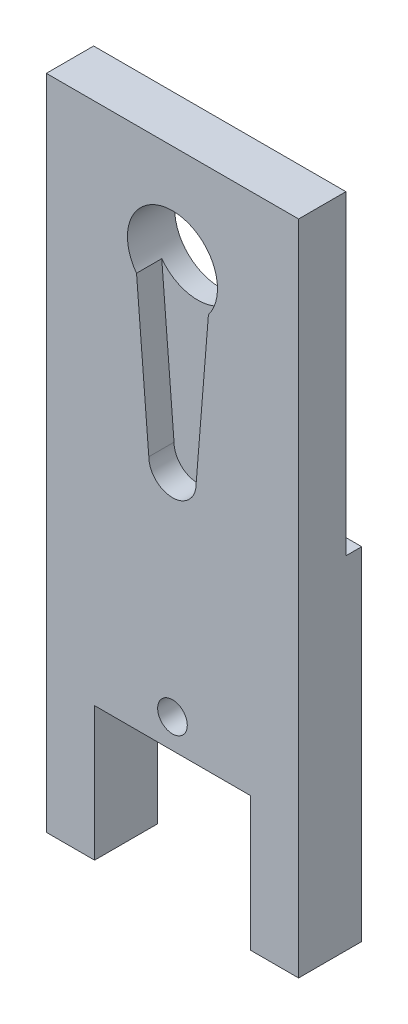
ISO-10303-21;
HEADER;
FILE_DESCRIPTION(('STEP AP214'),'2;1');
FILE_NAME('part.step','',(''),(''),'','','');
FILE_SCHEMA(('AUTOMOTIVE_DESIGN { 1 0 10303 214 1 1 1 1 }'));
ENDSEC;
DATA;
#1=APPLICATION_CONTEXT('core data for automotive mechanical design processes');
#2=APPLICATION_PROTOCOL_DEFINITION('international standard','automotive_design',2000,#1);
#3=PRODUCT_CONTEXT('',#1,'mechanical');
#4=PRODUCT('Part','Part','',(#3));
#5=PRODUCT_RELATED_PRODUCT_CATEGORY('part','',(#4));
#6=PRODUCT_DEFINITION_FORMATION('','',#4);
#7=PRODUCT_DEFINITION_CONTEXT('part definition',#1,'design');
#8=PRODUCT_DEFINITION('design','',#6,#7);
#9=PRODUCT_DEFINITION_SHAPE('','',#8);
#10=(LENGTH_UNIT() NAMED_UNIT(*) SI_UNIT(.MILLI.,.METRE.));
#11=(NAMED_UNIT(*) PLANE_ANGLE_UNIT() SI_UNIT($,.RADIAN.));
#12=(NAMED_UNIT(*) SI_UNIT($,.STERADIAN.) SOLID_ANGLE_UNIT());
#13=UNCERTAINTY_MEASURE_WITH_UNIT(LENGTH_MEASURE(1.E-05),#10,'distance_accuracy_value','');
#14=(GEOMETRIC_REPRESENTATION_CONTEXT(3) GLOBAL_UNCERTAINTY_ASSIGNED_CONTEXT((#13)) GLOBAL_UNIT_ASSIGNED_CONTEXT((#10,
#11,#12)) REPRESENTATION_CONTEXT('',''));
#15=CARTESIAN_POINT('',(0.,0.,0.));
#16=DIRECTION('',(0.,0.,1.));
#17=DIRECTION('',(1.,0.,0.));
#18=AXIS2_PLACEMENT_3D('',#15,#16,#17);
#19=CARTESIAN_POINT('',(9.99999999999999,35.,5.));
#20=DIRECTION('',(-1.,0.,0.));
#21=DIRECTION('',(0.,-1.,0.));
#22=AXIS2_PLACEMENT_3D('',#19,#20,#21);
#23=PLANE('',#22);
#24=DIRECTION('',(0.,1.,0.));
#25=VECTOR('',#24,1.);
#26=CARTESIAN_POINT('',(9.99999999999999,35.,5.));
#27=LINE('',#26,#25);
#28=CARTESIAN_POINT('',(10.,-17.1146771652388,5.));
#29=VERTEX_POINT('',#28);
#30=CARTESIAN_POINT('',(9.99999999999999,35.,5.));
#31=VERTEX_POINT('',#30);
#32=EDGE_CURVE('E158',#29,#31,#27,.T.);
#33=ORIENTED_EDGE('',*,*,#32,.F.);
#34=DIRECTION('',(0.,0.,1.));
#35=VECTOR('',#34,1.);
#36=CARTESIAN_POINT('',(10.,-17.1146771652388,-5.));
#37=LINE('',#36,#35);
#38=CARTESIAN_POINT('',(10.,-17.1146771652388,0.));
#39=VERTEX_POINT('',#38);
#40=EDGE_CURVE('E145',#39,#29,#37,.T.);
#41=ORIENTED_EDGE('',*,*,#40,.F.);
#42=DIRECTION('',(0.,1.,0.));
#43=VECTOR('',#42,1.);
#44=CARTESIAN_POINT('',(9.99999999999999,35.,0.));
#45=LINE('',#44,#43);
#46=CARTESIAN_POINT('',(10.,10.,0.));
#47=VERTEX_POINT('',#46);
#48=EDGE_CURVE('E173',#39,#47,#45,.T.);
#49=ORIENTED_EDGE('',*,*,#48,.T.);
#50=DIRECTION('',(0.,0.,-1.));
#51=VECTOR('',#50,1.);
#52=CARTESIAN_POINT('',(10.,10.,0.));
#53=LINE('',#52,#51);
#54=CARTESIAN_POINT('',(10.,10.,1.25));
#55=VERTEX_POINT('',#54);
#56=EDGE_CURVE('E203',#55,#47,#53,.T.);
#57=ORIENTED_EDGE('',*,*,#56,.F.);
#58=DIRECTION('',(0.,-1.,0.));
#59=VECTOR('',#58,1.);
#60=CARTESIAN_POINT('',(9.99999999999999,35.,1.25));
#61=LINE('',#60,#59);
#62=CARTESIAN_POINT('',(9.99999999999999,35.,1.25));
#63=VERTEX_POINT('',#62);
#64=EDGE_CURVE('E357',#63,#55,#61,.T.);
#65=ORIENTED_EDGE('',*,*,#64,.F.);
#66=DIRECTION('',(0.,0.,-1.));
#67=VECTOR('',#66,1.);
#68=CARTESIAN_POINT('',(9.99999999999999,35.,5.));
#69=LINE('',#68,#67);
#70=EDGE_CURVE('E55',#31,#63,#69,.T.);
#71=ORIENTED_EDGE('',*,*,#70,.F.);
#72=EDGE_LOOP('',(#33,#41,#49,#57,#65,#71));
#73=FACE_BOUND('',#72,.T.);
#74=ADVANCED_FACE('F48',(#73),#23,.F.);
#75=CARTESIAN_POINT('',(-10.,35.,5.));
#76=DIRECTION('',(0.,-1.,0.));
#77=DIRECTION('',(0.,0.,-1.));
#78=AXIS2_PLACEMENT_3D('',#75,#76,#77);
#79=PLANE('',#78);
#80=ORIENTED_EDGE('',*,*,#70,.T.);
#81=DIRECTION('',(1.,0.,0.));
#82=VECTOR('',#81,1.);
#83=CARTESIAN_POINT('',(-20.,35.,1.25));
#84=LINE('',#83,#82);
#85=CARTESIAN_POINT('',(-10.,35.,1.25));
#86=VERTEX_POINT('',#85);
#87=EDGE_CURVE('E200',#86,#63,#84,.T.);
#88=ORIENTED_EDGE('',*,*,#87,.F.);
#89=DIRECTION('',(0.,0.,-1.));
#90=VECTOR('',#89,1.);
#91=CARTESIAN_POINT('',(-10.,35.,5.));
#92=LINE('',#91,#90);
#93=CARTESIAN_POINT('',(-10.,35.,5.));
#94=VERTEX_POINT('',#93);
#95=EDGE_CURVE('E181',#94,#86,#92,.T.);
#96=ORIENTED_EDGE('',*,*,#95,.F.);
#97=DIRECTION('',(-1.,0.,0.));
#98=VECTOR('',#97,1.);
#99=CARTESIAN_POINT('',(-10.,35.,5.));
#100=LINE('',#99,#98);
#101=EDGE_CURVE('E167',#31,#94,#100,.T.);
#102=ORIENTED_EDGE('',*,*,#101,.F.);
#103=EDGE_LOOP('',(#80,#88,#96,#102));
#104=FACE_BOUND('',#103,.T.);
#105=ADVANCED_FACE('F292',(#104),#79,.F.);
#106=CARTESIAN_POINT('',(-10.,35.,5.));
#107=DIRECTION('',(1.,0.,0.));
#108=DIRECTION('',(0.,1.,0.));
#109=AXIS2_PLACEMENT_3D('',#106,#107,#108);
#110=PLANE('',#109);
#111=DIRECTION('',(0.,-1.,0.));
#112=VECTOR('',#111,1.);
#113=CARTESIAN_POINT('',(-10.,35.,0.));
#114=LINE('',#113,#112);
#115=CARTESIAN_POINT('',(-10.,10.,0.));
#116=VERTEX_POINT('',#115);
#117=CARTESIAN_POINT('',(-10.,-17.1146771652388,0.));
#118=VERTEX_POINT('',#117);
#119=EDGE_CURVE('E168',#116,#118,#114,.T.);
#120=ORIENTED_EDGE('',*,*,#119,.T.);
#121=DIRECTION('',(0.,0.,1.));
#122=VECTOR('',#121,1.);
#123=CARTESIAN_POINT('',(-10.,-17.1146771652388,-5.));
#124=LINE('',#123,#122);
#125=CARTESIAN_POINT('',(-10.,-17.1146771652388,5.));
#126=VERTEX_POINT('',#125);
#127=EDGE_CURVE('E152',#118,#126,#124,.T.);
#128=ORIENTED_EDGE('',*,*,#127,.T.);
#129=DIRECTION('',(0.,-1.,0.));
#130=VECTOR('',#129,1.);
#131=CARTESIAN_POINT('',(-10.,35.,5.));
#132=LINE('',#131,#130);
#133=EDGE_CURVE('E170',#94,#126,#132,.T.);
#134=ORIENTED_EDGE('',*,*,#133,.F.);
#135=ORIENTED_EDGE('',*,*,#95,.T.);
#136=DIRECTION('',(0.,-1.,0.));
#137=VECTOR('',#136,1.);
#138=CARTESIAN_POINT('',(-10.,35.,1.25));
#139=LINE('',#138,#137);
#140=CARTESIAN_POINT('',(-10.,10.,1.25));
#141=VERTEX_POINT('',#140);
#142=EDGE_CURVE('E188',#86,#141,#139,.T.);
#143=ORIENTED_EDGE('',*,*,#142,.T.);
#144=DIRECTION('',(0.,0.,-1.));
#145=VECTOR('',#144,1.);
#146=CARTESIAN_POINT('',(-10.,10.,5.));
#147=LINE('',#146,#145);
#148=EDGE_CURVE('E193',#141,#116,#147,.T.);
#149=ORIENTED_EDGE('',*,*,#148,.T.);
#150=EDGE_LOOP('',(#120,#128,#134,#135,#143,#149));
#151=FACE_BOUND('',#150,.T.);
#152=ADVANCED_FACE('F296',(#151),#110,.F.);
#153=CARTESIAN_POINT('',(0.,0.,5.));
#154=DIRECTION('',(0.,0.,1.));
#155=DIRECTION('',(1.,0.,0.));
#156=AXIS2_PLACEMENT_3D('',#153,#154,#155);
#157=PLANE('',#156);
#158=DIRECTION('',(-1.,0.,0.));
#159=VECTOR('',#158,1.);
#160=CARTESIAN_POINT('',(-10.,-17.1146771652388,5.));
#161=LINE('',#160,#159);
#162=CARTESIAN_POINT('',(6.175,-17.1146771652388,5.));
#163=VERTEX_POINT('',#162);
#164=EDGE_CURVE('E62',#29,#163,#161,.T.);
#165=ORIENTED_EDGE('',*,*,#164,.F.);
#166=ORIENTED_EDGE('',*,*,#32,.T.);
#167=ORIENTED_EDGE('',*,*,#101,.T.);
#168=ORIENTED_EDGE('',*,*,#133,.T.);
#169=CARTESIAN_POINT('',(-6.175,-17.1146771652388,5.));
#170=VERTEX_POINT('',#169);
#171=EDGE_CURVE('E162',#170,#126,#161,.T.);
#172=ORIENTED_EDGE('',*,*,#171,.F.);
#173=DIRECTION('',(0.,-1.,0.));
#174=VECTOR('',#173,1.);
#175=CARTESIAN_POINT('',(-6.175,-6.49999999999998,5.));
#176=LINE('',#175,#174);
#177=CARTESIAN_POINT('',(-6.175,-6.49999999999998,5.));
#178=VERTEX_POINT('',#177);
#179=EDGE_CURVE('E218',#178,#170,#176,.T.);
#180=ORIENTED_EDGE('',*,*,#179,.F.);
#181=DIRECTION('',(-1.,0.,0.));
#182=VECTOR('',#181,1.);
#183=CARTESIAN_POINT('',(-6.175,-6.49999999999998,5.));
#184=LINE('',#183,#182);
#185=CARTESIAN_POINT('',(6.175,-6.49999999999998,5.));
#186=VERTEX_POINT('',#185);
#187=EDGE_CURVE('E226',#186,#178,#184,.T.);
#188=ORIENTED_EDGE('',*,*,#187,.F.);
#189=DIRECTION('',(0.,1.,0.));
#190=VECTOR('',#189,1.);
#191=CARTESIAN_POINT('',(6.175,-6.49999999999998,5.));
#192=LINE('',#191,#190);
#193=EDGE_CURVE('E161',#163,#186,#192,.T.);
#194=ORIENTED_EDGE('',*,*,#193,.F.);
#195=EDGE_LOOP('',(#165,#166,#167,#168,#172,#180,#188,#194));
#196=FACE_BOUND('',#195,.T.);
#197=CARTESIAN_POINT('',(0.,-4.17999999999999,5.));
#198=DIRECTION('',(0.,0.,1.));
#199=DIRECTION('',(1.,0.,0.));
#200=AXIS2_PLACEMENT_3D('',#197,#198,#199);
#201=CIRCLE('',#200,1.175);
#202=CARTESIAN_POINT('',(1.175,-4.17999999999999,5.));
#203=VERTEX_POINT('',#202);
#204=EDGE_CURVE('E209',#203,#203,#201,.T.);
#205=ORIENTED_EDGE('',*,*,#204,.F.);
#206=EDGE_LOOP('',(#205));
#207=FACE_BOUND('',#206,.T.);
#208=CARTESIAN_POINT('',(0.,12.7392068094734,5.));
#209=DIRECTION('',(0.,0.,1.));
#210=DIRECTION('',(1.,0.,0.));
#211=AXIS2_PLACEMENT_3D('',#208,#209,#210);
#212=CIRCLE('',#211,1.875);
#213=CARTESIAN_POINT('',(-1.875,12.7392068094734,5.));
#214=VERTEX_POINT('',#213);
#215=CARTESIAN_POINT('',(1.875,12.7392068094734,5.));
#216=VERTEX_POINT('',#215);
#217=EDGE_CURVE('E247',#214,#216,#212,.T.);
#218=ORIENTED_EDGE('',*,*,#217,.F.);
#219=DIRECTION('',(0.0802469135802469,-0.996775016170071,0.));
#220=VECTOR('',#219,1.);
#221=CARTESIAN_POINT('',(-0.843940626703052,-0.0679427447912119,5.));
#222=LINE('',#221,#220);
#223=CARTESIAN_POINT('',(-2.85,24.8500232559397,5.));
#224=VERTEX_POINT('',#223);
#225=EDGE_CURVE('E241',#224,#214,#222,.T.);
#226=ORIENTED_EDGE('',*,*,#225,.F.);
#227=CARTESIAN_POINT('',(0.,27.,5.));
#228=DIRECTION('',(0.,0.,1.));
#229=DIRECTION('',(1.,0.,0.));
#230=AXIS2_PLACEMENT_3D('',#227,#228,#229);
#231=CIRCLE('',#230,3.57);
#232=CARTESIAN_POINT('',(2.85,24.8500232559397,5.));
#233=VERTEX_POINT('',#232);
#234=EDGE_CURVE('E176',#233,#224,#231,.T.);
#235=ORIENTED_EDGE('',*,*,#234,.F.);
#236=DIRECTION('',(-0.0802469135802469,-0.996775016170071,0.));
#237=VECTOR('',#236,1.);
#238=CARTESIAN_POINT('',(0.843940626703052,-0.0679427447912119,5.));
#239=LINE('',#238,#237);
#240=EDGE_CURVE('E250',#233,#216,#239,.T.);
#241=ORIENTED_EDGE('',*,*,#240,.T.);
#242=EDGE_LOOP('',(#218,#226,#235,#241));
#243=FACE_BOUND('',#242,.T.);
#244=ADVANCED_FACE('F156',(#196,#207,#243),#157,.T.);
#245=CARTESIAN_POINT('',(0.,0.,0.));
#246=DIRECTION('',(0.,0.,1.));
#247=DIRECTION('',(1.,0.,0.));
#248=AXIS2_PLACEMENT_3D('',#245,#246,#247);
#249=PLANE('',#248);
#250=CARTESIAN_POINT('',(0.,-4.17999999999999,0.));
#251=DIRECTION('',(0.,0.,1.));
#252=DIRECTION('',(1.,0.,0.));
#253=AXIS2_PLACEMENT_3D('',#250,#251,#252);
#254=CIRCLE('',#253,1.175);
#255=CARTESIAN_POINT('',(1.175,-4.17999999999999,0.));
#256=VERTEX_POINT('',#255);
#257=EDGE_CURVE('E210',#256,#256,#254,.T.);
#258=ORIENTED_EDGE('',*,*,#257,.T.);
#259=EDGE_LOOP('',(#258));
#260=FACE_BOUND('',#259,.T.);
#261=ORIENTED_EDGE('',*,*,#48,.F.);
#262=DIRECTION('',(-1.,0.,0.));
#263=VECTOR('',#262,1.);
#264=CARTESIAN_POINT('',(0.,-17.1146771652388,0.));
#265=LINE('',#264,#263);
#266=CARTESIAN_POINT('',(6.175,-17.1146771652388,0.));
#267=VERTEX_POINT('',#266);
#268=EDGE_CURVE('E148',#39,#267,#265,.T.);
#269=ORIENTED_EDGE('',*,*,#268,.T.);
#270=DIRECTION('',(0.,1.,0.));
#271=VECTOR('',#270,1.);
#272=CARTESIAN_POINT('',(6.175,-6.49999999999998,0.));
#273=LINE('',#272,#271);
#274=CARTESIAN_POINT('',(6.175,-6.49999999999998,0.));
#275=VERTEX_POINT('',#274);
#276=EDGE_CURVE('E215',#267,#275,#273,.T.);
#277=ORIENTED_EDGE('',*,*,#276,.T.);
#278=DIRECTION('',(-1.,0.,0.));
#279=VECTOR('',#278,1.);
#280=CARTESIAN_POINT('',(-6.175,-6.49999999999998,0.));
#281=LINE('',#280,#279);
#282=CARTESIAN_POINT('',(-6.175,-6.49999999999998,0.));
#283=VERTEX_POINT('',#282);
#284=EDGE_CURVE('E217',#275,#283,#281,.T.);
#285=ORIENTED_EDGE('',*,*,#284,.T.);
#286=DIRECTION('',(0.,-1.,0.));
#287=VECTOR('',#286,1.);
#288=CARTESIAN_POINT('',(-6.175,-6.49999999999998,0.));
#289=LINE('',#288,#287);
#290=CARTESIAN_POINT('',(-6.175,-17.1146771652388,0.));
#291=VERTEX_POINT('',#290);
#292=EDGE_CURVE('E221',#283,#291,#289,.T.);
#293=ORIENTED_EDGE('',*,*,#292,.T.);
#294=EDGE_CURVE('E70',#291,#118,#265,.T.);
#295=ORIENTED_EDGE('',*,*,#294,.T.);
#296=ORIENTED_EDGE('',*,*,#119,.F.);
#297=DIRECTION('',(1.,0.,0.));
#298=VECTOR('',#297,1.);
#299=CARTESIAN_POINT('',(-20.,10.,0.));
#300=LINE('',#299,#298);
#301=EDGE_CURVE('E189',#116,#47,#300,.T.);
#302=ORIENTED_EDGE('',*,*,#301,.T.);
#303=EDGE_LOOP('',(#261,#269,#277,#285,#293,#295,#296,#302));
#304=FACE_BOUND('',#303,.T.);
#305=ADVANCED_FACE('F288',(#260,#304),#249,.F.);
#306=CARTESIAN_POINT('',(0.,12.7392068094734,3.));
#307=DIRECTION('',(0.,0.,1.));
#308=DIRECTION('',(1.,0.,0.));
#309=AXIS2_PLACEMENT_3D('',#306,#307,#308);
#310=CYLINDRICAL_SURFACE('',#309,1.875);
#311=ORIENTED_EDGE('',*,*,#217,.T.);
#312=DIRECTION('',(0.,0.,1.));
#313=VECTOR('',#312,1.);
#314=CARTESIAN_POINT('',(1.875,12.7392068094734,3.));
#315=LINE('',#314,#313);
#316=CARTESIAN_POINT('',(1.875,12.7392068094734,3.));
#317=VERTEX_POINT('',#316);
#318=EDGE_CURVE('E246',#317,#216,#315,.T.);
#319=ORIENTED_EDGE('',*,*,#318,.F.);
#320=CARTESIAN_POINT('',(0.,12.7392068094734,3.));
#321=DIRECTION('',(0.,0.,1.));
#322=DIRECTION('',(1.,0.,0.));
#323=AXIS2_PLACEMENT_3D('',#320,#321,#322);
#324=CIRCLE('',#323,1.875);
#325=CARTESIAN_POINT('',(-1.875,12.7392068094734,3.));
#326=VERTEX_POINT('',#325);
#327=EDGE_CURVE('E237',#326,#317,#324,.T.);
#328=ORIENTED_EDGE('',*,*,#327,.F.);
#329=DIRECTION('',(0.,0.,1.));
#330=VECTOR('',#329,1.);
#331=CARTESIAN_POINT('',(-1.875,12.7392068094734,3.));
#332=LINE('',#331,#330);
#333=EDGE_CURVE('E182',#326,#214,#332,.T.);
#334=ORIENTED_EDGE('',*,*,#333,.T.);
#335=EDGE_LOOP('',(#311,#319,#328,#334));
#336=FACE_BOUND('',#335,.T.);
#337=ADVANCED_FACE('F268',(#336),#310,.F.);
#338=CARTESIAN_POINT('',(-0.843940626703052,-0.0679427447912119,3.));
#339=DIRECTION('',(-0.996775016170071,-0.0802469135802469,0.));
#340=DIRECTION('',(0.0802469135802469,-0.996775016170071,0.));
#341=AXIS2_PLACEMENT_3D('',#338,#339,#340);
#342=PLANE('',#341);
#343=ORIENTED_EDGE('',*,*,#225,.T.);
#344=ORIENTED_EDGE('',*,*,#333,.F.);
#345=DIRECTION('',(0.0802469135802469,-0.996775016170071,0.));
#346=VECTOR('',#345,1.);
#347=CARTESIAN_POINT('',(-0.843940626703052,-0.0679427447912119,3.));
#348=LINE('',#347,#346);
#349=CARTESIAN_POINT('',(-2.85,24.8500232559397,3.));
#350=VERTEX_POINT('',#349);
#351=EDGE_CURVE('E243',#350,#326,#348,.T.);
#352=ORIENTED_EDGE('',*,*,#351,.F.);
#353=DIRECTION('',(0.,0.,1.));
#354=VECTOR('',#353,1.);
#355=CARTESIAN_POINT('',(-2.85,24.8500232559397,3.));
#356=LINE('',#355,#354);
#357=EDGE_CURVE('E256',#350,#224,#356,.T.);
#358=ORIENTED_EDGE('',*,*,#357,.T.);
#359=EDGE_LOOP('',(#343,#344,#352,#358));
#360=FACE_BOUND('',#359,.T.);
#361=ADVANCED_FACE('F280',(#360),#342,.F.);
#362=CARTESIAN_POINT('',(0.843940626703052,-0.0679427447912119,3.));
#363=DIRECTION('',(-0.996775016170071,0.0802469135802469,0.));
#364=DIRECTION('',(-0.0802469135802469,-0.996775016170071,0.));
#365=AXIS2_PLACEMENT_3D('',#362,#363,#364);
#366=PLANE('',#365);
#367=ORIENTED_EDGE('',*,*,#240,.F.);
#368=DIRECTION('',(0.,0.,1.));
#369=VECTOR('',#368,1.);
#370=CARTESIAN_POINT('',(2.85,24.8500232559397,3.));
#371=LINE('',#370,#369);
#372=CARTESIAN_POINT('',(2.85,24.8500232559397,3.));
#373=VERTEX_POINT('',#372);
#374=EDGE_CURVE('E258',#373,#233,#371,.T.);
#375=ORIENTED_EDGE('',*,*,#374,.F.);
#376=DIRECTION('',(-0.0802469135802469,-0.996775016170071,0.));
#377=VECTOR('',#376,1.);
#378=CARTESIAN_POINT('',(0.843940626703052,-0.0679427447912119,3.));
#379=LINE('',#378,#377);
#380=EDGE_CURVE('E240',#373,#317,#379,.T.);
#381=ORIENTED_EDGE('',*,*,#380,.T.);
#382=ORIENTED_EDGE('',*,*,#318,.T.);
#383=EDGE_LOOP('',(#367,#375,#381,#382));
#384=FACE_BOUND('',#383,.T.);
#385=ADVANCED_FACE('F262',(#384),#366,.T.);
#386=CARTESIAN_POINT('',(0.,0.,3.));
#387=DIRECTION('',(0.,0.,1.));
#388=DIRECTION('',(1.,0.,0.));
#389=AXIS2_PLACEMENT_3D('',#386,#387,#388);
#390=PLANE('',#389);
#391=CARTESIAN_POINT('',(0.,27.,3.));
#392=DIRECTION('',(0.,0.,1.));
#393=DIRECTION('',(1.,0.,0.));
#394=AXIS2_PLACEMENT_3D('',#391,#392,#393);
#395=CIRCLE('',#394,3.57);
#396=EDGE_CURVE('E233',#350,#373,#395,.T.);
#397=ORIENTED_EDGE('',*,*,#396,.F.);
#398=ORIENTED_EDGE('',*,*,#351,.T.);
#399=ORIENTED_EDGE('',*,*,#327,.T.);
#400=ORIENTED_EDGE('',*,*,#380,.F.);
#401=EDGE_LOOP('',(#397,#398,#399,#400));
#402=FACE_BOUND('',#401,.T.);
#403=ADVANCED_FACE('F278',(#402),#390,.T.);
#404=CARTESIAN_POINT('',(0.,27.,3.));
#405=DIRECTION('',(0.,0.,1.));
#406=DIRECTION('',(1.,0.,0.));
#407=AXIS2_PLACEMENT_3D('',#404,#405,#406);
#408=CYLINDRICAL_SURFACE('',#407,3.57);
#409=CARTESIAN_POINT('',(0.,27.,1.25));
#410=DIRECTION('',(0.,0.,1.));
#411=DIRECTION('',(0.,-1.,0.));
#412=AXIS2_PLACEMENT_3D('',#409,#410,#411);
#413=CIRCLE('',#412,3.57);
#414=CARTESIAN_POINT('',(0.,23.43,1.25));
#415=VERTEX_POINT('',#414);
#416=EDGE_CURVE('E186',#415,#415,#413,.F.);
#417=ORIENTED_EDGE('',*,*,#416,.T.);
#418=EDGE_LOOP('',(#417));
#419=FACE_BOUND('',#418,.T.);
#420=ORIENTED_EDGE('',*,*,#357,.F.);
#421=ORIENTED_EDGE('',*,*,#396,.T.);
#422=ORIENTED_EDGE('',*,*,#374,.T.);
#423=ORIENTED_EDGE('',*,*,#234,.T.);
#424=EDGE_LOOP('',(#420,#421,#422,#423));
#425=FACE_BOUND('',#424,.T.);
#426=ADVANCED_FACE('F275',(#419,#425),#408,.F.);
#427=CARTESIAN_POINT('',(6.175,-6.49999999999998,0.));
#428=DIRECTION('',(1.,0.,0.));
#429=DIRECTION('',(0.,1.,0.));
#430=AXIS2_PLACEMENT_3D('',#427,#428,#429);
#431=PLANE('',#430);
#432=ORIENTED_EDGE('',*,*,#276,.F.);
#433=DIRECTION('',(0.,0.,1.));
#434=VECTOR('',#433,1.);
#435=CARTESIAN_POINT('',(6.175,-17.1146771652388,0.));
#436=LINE('',#435,#434);
#437=EDGE_CURVE('E355',#267,#163,#436,.T.);
#438=ORIENTED_EDGE('',*,*,#437,.T.);
#439=ORIENTED_EDGE('',*,*,#193,.T.);
#440=DIRECTION('',(0.,0.,1.));
#441=VECTOR('',#440,1.);
#442=CARTESIAN_POINT('',(6.175,-6.49999999999998,0.));
#443=LINE('',#442,#441);
#444=EDGE_CURVE('E224',#275,#186,#443,.T.);
#445=ORIENTED_EDGE('',*,*,#444,.F.);
#446=EDGE_LOOP('',(#432,#438,#439,#445));
#447=FACE_BOUND('',#446,.T.);
#448=ADVANCED_FACE('F310',(#447),#431,.F.);
#449=CARTESIAN_POINT('',(-6.175,-6.49999999999998,0.));
#450=DIRECTION('',(-1.,0.,0.));
#451=DIRECTION('',(0.,-1.,0.));
#452=AXIS2_PLACEMENT_3D('',#449,#450,#451);
#453=PLANE('',#452);
#454=ORIENTED_EDGE('',*,*,#179,.T.);
#455=DIRECTION('',(0.,0.,-1.));
#456=VECTOR('',#455,1.);
#457=CARTESIAN_POINT('',(-6.175,-17.1146771652388,0.));
#458=LINE('',#457,#456);
#459=EDGE_CURVE('E12',#170,#291,#458,.T.);
#460=ORIENTED_EDGE('',*,*,#459,.T.);
#461=ORIENTED_EDGE('',*,*,#292,.F.);
#462=DIRECTION('',(0.,0.,1.));
#463=VECTOR('',#462,1.);
#464=CARTESIAN_POINT('',(-6.175,-6.49999999999998,0.));
#465=LINE('',#464,#463);
#466=EDGE_CURVE('E231',#283,#178,#465,.T.);
#467=ORIENTED_EDGE('',*,*,#466,.T.);
#468=EDGE_LOOP('',(#454,#460,#461,#467));
#469=FACE_BOUND('',#468,.T.);
#470=ADVANCED_FACE('F315',(#469),#453,.F.);
#471=CARTESIAN_POINT('',(-6.175,-6.49999999999998,0.));
#472=DIRECTION('',(0.,1.,0.));
#473=DIRECTION('',(-1.,0.,0.));
#474=AXIS2_PLACEMENT_3D('',#471,#472,#473);
#475=PLANE('',#474);
#476=ORIENTED_EDGE('',*,*,#187,.T.);
#477=ORIENTED_EDGE('',*,*,#466,.F.);
#478=ORIENTED_EDGE('',*,*,#284,.F.);
#479=ORIENTED_EDGE('',*,*,#444,.T.);
#480=EDGE_LOOP('',(#476,#477,#478,#479));
#481=FACE_BOUND('',#480,.T.);
#482=ADVANCED_FACE('F321',(#481),#475,.F.);
#483=CARTESIAN_POINT('',(0.,-4.17999999999999,0.));
#484=DIRECTION('',(0.,0.,1.));
#485=DIRECTION('',(1.,0.,0.));
#486=AXIS2_PLACEMENT_3D('',#483,#484,#485);
#487=CYLINDRICAL_SURFACE('',#486,1.175);
#488=ORIENTED_EDGE('',*,*,#257,.F.);
#489=EDGE_LOOP('',(#488));
#490=FACE_BOUND('',#489,.T.);
#491=ORIENTED_EDGE('',*,*,#204,.T.);
#492=EDGE_LOOP('',(#491));
#493=FACE_BOUND('',#492,.T.);
#494=ADVANCED_FACE('F324',(#490,#493),#487,.F.);
#495=CARTESIAN_POINT('',(-20.,10.,0.));
#496=DIRECTION('',(0.,-1.,0.));
#497=DIRECTION('',(1.,0.,0.));
#498=AXIS2_PLACEMENT_3D('',#495,#496,#497);
#499=PLANE('',#498);
#500=DIRECTION('',(1.,0.,0.));
#501=VECTOR('',#500,1.);
#502=CARTESIAN_POINT('',(-20.,10.,1.25));
#503=LINE('',#502,#501);
#504=EDGE_CURVE('E196',#141,#55,#503,.T.);
#505=ORIENTED_EDGE('',*,*,#504,.T.);
#506=ORIENTED_EDGE('',*,*,#56,.T.);
#507=ORIENTED_EDGE('',*,*,#301,.F.);
#508=ORIENTED_EDGE('',*,*,#148,.F.);
#509=EDGE_LOOP('',(#505,#506,#507,#508));
#510=FACE_BOUND('',#509,.T.);
#511=ADVANCED_FACE('F331',(#510),#499,.F.);
#512=CARTESIAN_POINT('',(-20.,35.,1.25));
#513=DIRECTION('',(0.,0.,1.));
#514=DIRECTION('',(0.,-1.,0.));
#515=AXIS2_PLACEMENT_3D('',#512,#513,#514);
#516=PLANE('',#515);
#517=ORIENTED_EDGE('',*,*,#416,.F.);
#518=EDGE_LOOP('',(#517));
#519=FACE_BOUND('',#518,.T.);
#520=ORIENTED_EDGE('',*,*,#87,.T.);
#521=ORIENTED_EDGE('',*,*,#64,.T.);
#522=ORIENTED_EDGE('',*,*,#504,.F.);
#523=ORIENTED_EDGE('',*,*,#142,.F.);
#524=EDGE_LOOP('',(#520,#521,#522,#523));
#525=FACE_BOUND('',#524,.T.);
#526=ADVANCED_FACE('F333',(#519,#525),#516,.F.);
#527=CARTESIAN_POINT('',(-10.,-17.1146771652388,-5.));
#528=DIRECTION('',(0.,1.,0.));
#529=DIRECTION('',(0.,0.,1.));
#530=AXIS2_PLACEMENT_3D('',#527,#528,#529);
#531=PLANE('',#530);
#532=ORIENTED_EDGE('',*,*,#459,.F.);
#533=ORIENTED_EDGE('',*,*,#171,.T.);
#534=ORIENTED_EDGE('',*,*,#127,.F.);
#535=ORIENTED_EDGE('',*,*,#294,.F.);
#536=EDGE_LOOP('',(#532,#533,#534,#535));
#537=FACE_BOUND('',#536,.T.);
#538=ADVANCED_FACE('F336',(#537),#531,.F.);
#539=ORIENTED_EDGE('',*,*,#40,.T.);
#540=ORIENTED_EDGE('',*,*,#164,.T.);
#541=ORIENTED_EDGE('',*,*,#437,.F.);
#542=ORIENTED_EDGE('',*,*,#268,.F.);
#543=EDGE_LOOP('',(#539,#540,#541,#542));
#544=FACE_BOUND('',#543,.T.);
#545=ADVANCED_FACE('F146',(#544),#531,.F.);
#546=CLOSED_SHELL('',(#74,#105,#152,#244,#305,#337,#361,#385,#403,#426,#448,#470,#482,#494,#511,
#526,#538,#545));
#547=MANIFOLD_SOLID_BREP('B2',#546);
#548=ADVANCED_BREP_SHAPE_REPRESENTATION('',(#18,#547),#14);
#549=SHAPE_DEFINITION_REPRESENTATION(#9,#548);
ENDSEC;
END-ISO-10303-21;
